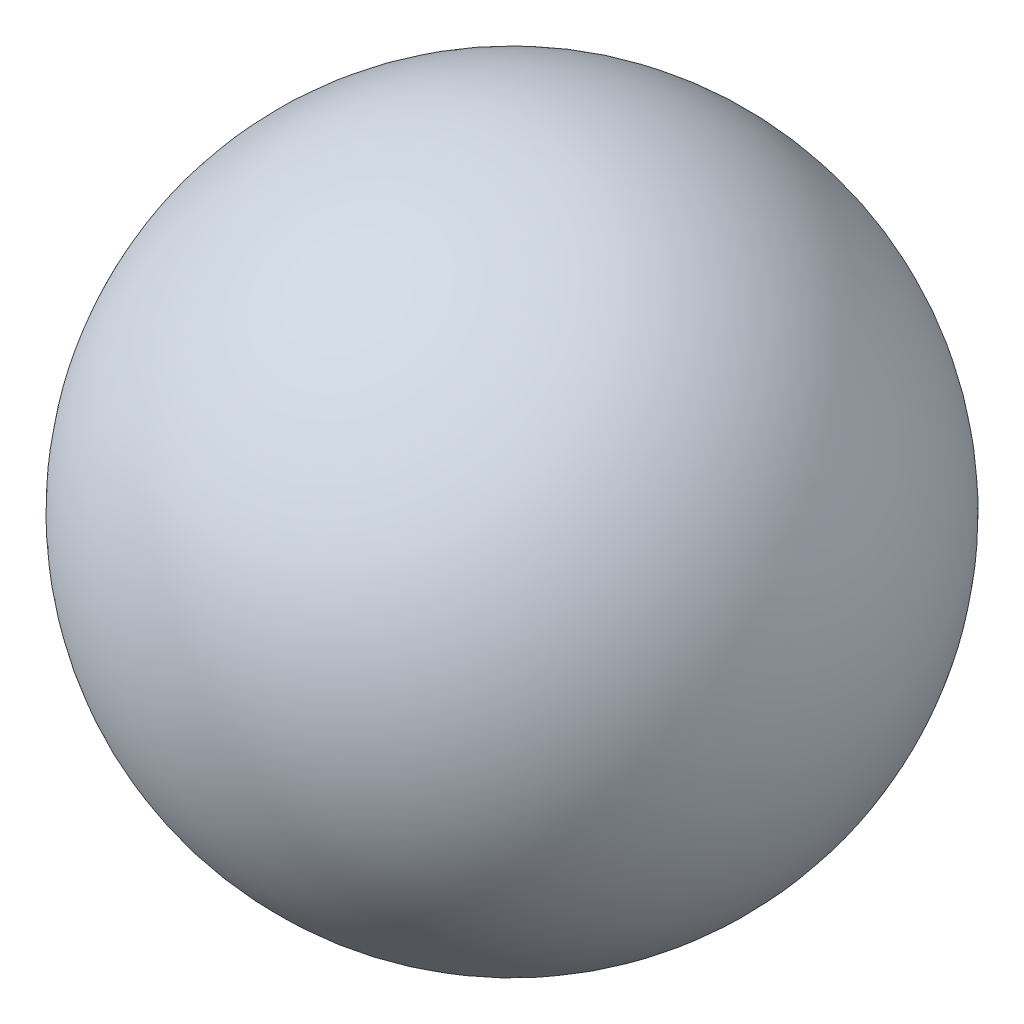
ISO-10303-21;
HEADER;
FILE_DESCRIPTION(('STEP AP214'),'2;1');
FILE_NAME('part.step','',(''),(''),'','','');
FILE_SCHEMA(('AUTOMOTIVE_DESIGN { 1 0 10303 214 1 1 1 1 }'));
ENDSEC;
DATA;
#1=APPLICATION_CONTEXT('core data for automotive mechanical design processes');
#2=APPLICATION_PROTOCOL_DEFINITION('international standard','automotive_design',2000,#1);
#3=PRODUCT_CONTEXT('',#1,'mechanical');
#4=PRODUCT('Part','Part','',(#3));
#5=PRODUCT_RELATED_PRODUCT_CATEGORY('part','',(#4));
#6=PRODUCT_DEFINITION_FORMATION('','',#4);
#7=PRODUCT_DEFINITION_CONTEXT('part definition',#1,'design');
#8=PRODUCT_DEFINITION('design','',#6,#7);
#9=PRODUCT_DEFINITION_SHAPE('','',#8);
#10=(LENGTH_UNIT() NAMED_UNIT(*) SI_UNIT(.MILLI.,.METRE.));
#11=(NAMED_UNIT(*) PLANE_ANGLE_UNIT() SI_UNIT($,.RADIAN.));
#12=(NAMED_UNIT(*) SI_UNIT($,.STERADIAN.) SOLID_ANGLE_UNIT());
#13=UNCERTAINTY_MEASURE_WITH_UNIT(LENGTH_MEASURE(1.E-05),#10,'distance_accuracy_value','');
#14=(GEOMETRIC_REPRESENTATION_CONTEXT(3) GLOBAL_UNCERTAINTY_ASSIGNED_CONTEXT((#13)) GLOBAL_UNIT_ASSIGNED_CONTEXT((#10,
#11,#12)) REPRESENTATION_CONTEXT('',''));
#15=CARTESIAN_POINT('',(0.,0.,0.));
#16=DIRECTION('',(0.,0.,1.));
#17=DIRECTION('',(1.,0.,0.));
#18=AXIS2_PLACEMENT_3D('',#15,#16,#17);
#19=CARTESIAN_POINT('',(0.,0.,0.));
#20=DIRECTION('',(-1.,0.,0.));
#21=DIRECTION('',(0.,0.,-1.));
#22=AXIS2_PLACEMENT_3D('',#19,#20,#21);
#23=SPHERICAL_SURFACE('',#22,0.8);
#24=CARTESIAN_POINT('',(-0.8,0.,0.));
#25=VERTEX_POINT('',#24);
#26=VERTEX_LOOP('',#25);
#27=FACE_BOUND('',#26,.T.);
#28=ADVANCED_FACE('F29',(#27),#23,.T.);
#29=CLOSED_SHELL('',(#28));
#30=MANIFOLD_SOLID_BREP('B2',#29);
#31=ADVANCED_BREP_SHAPE_REPRESENTATION('',(#18,#30),#14);
#32=SHAPE_DEFINITION_REPRESENTATION(#9,#31);
ENDSEC;
END-ISO-10303-21;
